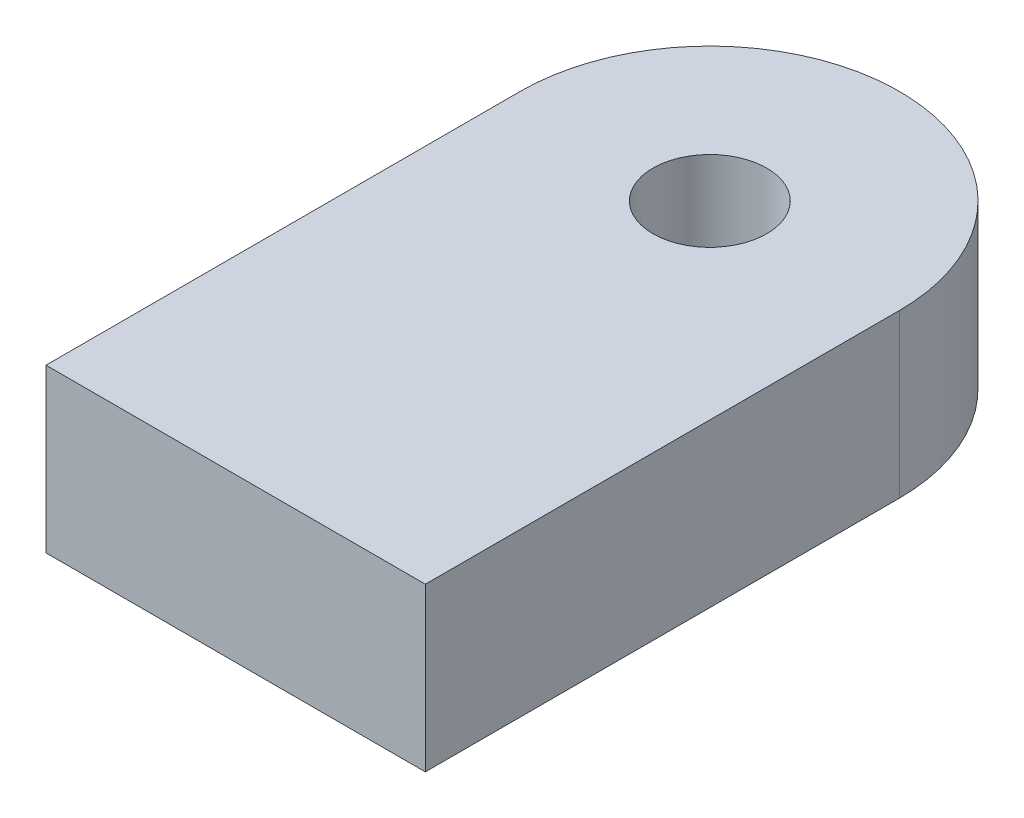
ISO-10303-21;
HEADER;
FILE_DESCRIPTION(('STEP AP214'),'2;1');
FILE_NAME('part.step','',(''),(''),'','','');
FILE_SCHEMA(('AUTOMOTIVE_DESIGN { 1 0 10303 214 1 1 1 1 }'));
ENDSEC;
DATA;
#1=APPLICATION_CONTEXT('core data for automotive mechanical design processes');
#2=APPLICATION_PROTOCOL_DEFINITION('international standard','automotive_design',2000,#1);
#3=PRODUCT_CONTEXT('',#1,'mechanical');
#4=PRODUCT('Part','Part','',(#3));
#5=PRODUCT_RELATED_PRODUCT_CATEGORY('part','',(#4));
#6=PRODUCT_DEFINITION_FORMATION('','',#4);
#7=PRODUCT_DEFINITION_CONTEXT('part definition',#1,'design');
#8=PRODUCT_DEFINITION('design','',#6,#7);
#9=PRODUCT_DEFINITION_SHAPE('','',#8);
#10=(LENGTH_UNIT() NAMED_UNIT(*) SI_UNIT(.MILLI.,.METRE.));
#11=(NAMED_UNIT(*) PLANE_ANGLE_UNIT() SI_UNIT($,.RADIAN.));
#12=(NAMED_UNIT(*) SI_UNIT($,.STERADIAN.) SOLID_ANGLE_UNIT());
#13=UNCERTAINTY_MEASURE_WITH_UNIT(LENGTH_MEASURE(1.E-05),#10,'distance_accuracy_value','');
#14=(GEOMETRIC_REPRESENTATION_CONTEXT(3) GLOBAL_UNCERTAINTY_ASSIGNED_CONTEXT((#13)) GLOBAL_UNIT_ASSIGNED_CONTEXT((#10,
#11,#12)) REPRESENTATION_CONTEXT('',''));
#15=CARTESIAN_POINT('',(0.,0.,0.));
#16=DIRECTION('',(0.,0.,1.));
#17=DIRECTION('',(1.,0.,0.));
#18=AXIS2_PLACEMENT_3D('',#15,#16,#17);
#19=CARTESIAN_POINT('',(0.,6.,-8.75));
#20=DIRECTION('',(0.,-1.,0.));
#21=DIRECTION('',(0.,0.,-1.));
#22=AXIS2_PLACEMENT_3D('',#19,#20,#21);
#23=PLANE('',#22);
#24=CARTESIAN_POINT('',(0.,6.,-8.75));
#25=DIRECTION('',(0.,1.,0.));
#26=DIRECTION('',(0.,0.,-1.));
#27=AXIS2_PLACEMENT_3D('',#24,#25,#26);
#28=CIRCLE('',#27,6.99999999999999);
#29=CARTESIAN_POINT('',(6.99999999999999,6.,-8.75));
#30=VERTEX_POINT('',#29);
#31=CARTESIAN_POINT('',(-6.99999999999999,6.,-8.75));
#32=VERTEX_POINT('',#31);
#33=EDGE_CURVE('E85',#30,#32,#28,.T.);
#34=ORIENTED_EDGE('',*,*,#33,.T.);
#35=DIRECTION('',(0.,0.,1.));
#36=VECTOR('',#35,1.);
#37=CARTESIAN_POINT('',(-7.00000000000001,6.,8.75));
#38=LINE('',#37,#36);
#39=CARTESIAN_POINT('',(-7.00000000000001,6.,8.75));
#40=VERTEX_POINT('',#39);
#41=EDGE_CURVE('E80',#32,#40,#38,.T.);
#42=ORIENTED_EDGE('',*,*,#41,.T.);
#43=DIRECTION('',(1.,0.,0.));
#44=VECTOR('',#43,1.);
#45=CARTESIAN_POINT('',(-7.00000000000001,6.,8.75));
#46=LINE('',#45,#44);
#47=CARTESIAN_POINT('',(6.99999999999999,6.,8.75000000000001));
#48=VERTEX_POINT('',#47);
#49=EDGE_CURVE('E83',#40,#48,#46,.T.);
#50=ORIENTED_EDGE('',*,*,#49,.T.);
#51=DIRECTION('',(0.,0.,-1.));
#52=VECTOR('',#51,1.);
#53=CARTESIAN_POINT('',(6.99999999999999,6.,8.75000000000001));
#54=LINE('',#53,#52);
#55=EDGE_CURVE('E50',#48,#30,#54,.T.);
#56=ORIENTED_EDGE('',*,*,#55,.T.);
#57=EDGE_LOOP('',(#34,#42,#50,#56));
#58=FACE_BOUND('',#57,.T.);
#59=CARTESIAN_POINT('',(0.,6.,-8.75));
#60=DIRECTION('',(0.,1.,0.));
#61=DIRECTION('',(0.,0.,1.));
#62=AXIS2_PLACEMENT_3D('',#59,#60,#61);
#63=CIRCLE('',#62,2.1);
#64=CARTESIAN_POINT('',(0.,6.,-6.65));
#65=VERTEX_POINT('',#64);
#66=EDGE_CURVE('E100',#65,#65,#63,.T.);
#67=ORIENTED_EDGE('',*,*,#66,.F.);
#68=EDGE_LOOP('',(#67));
#69=FACE_BOUND('',#68,.T.);
#70=ADVANCED_FACE('F33',(#58,#69),#23,.F.);
#71=CARTESIAN_POINT('',(0.,0.,-8.75));
#72=DIRECTION('',(0.,-1.,0.));
#73=DIRECTION('',(0.,0.,-1.));
#74=AXIS2_PLACEMENT_3D('',#71,#72,#73);
#75=PLANE('',#74);
#76=CARTESIAN_POINT('',(0.,0.,-8.75));
#77=DIRECTION('',(0.,1.,0.));
#78=DIRECTION('',(0.,0.,-1.));
#79=AXIS2_PLACEMENT_3D('',#76,#77,#78);
#80=CIRCLE('',#79,6.99999999999999);
#81=CARTESIAN_POINT('',(6.99999999999999,0.,-8.75));
#82=VERTEX_POINT('',#81);
#83=CARTESIAN_POINT('',(-6.99999999999999,0.,-8.75));
#84=VERTEX_POINT('',#83);
#85=EDGE_CURVE('E97',#82,#84,#80,.T.);
#86=ORIENTED_EDGE('',*,*,#85,.F.);
#87=DIRECTION('',(0.,0.,-1.));
#88=VECTOR('',#87,1.);
#89=CARTESIAN_POINT('',(6.99999999999999,0.,8.75000000000001));
#90=LINE('',#89,#88);
#91=CARTESIAN_POINT('',(6.99999999999999,0.,8.75000000000001));
#92=VERTEX_POINT('',#91);
#93=EDGE_CURVE('E73',#92,#82,#90,.T.);
#94=ORIENTED_EDGE('',*,*,#93,.F.);
#95=DIRECTION('',(1.,0.,0.));
#96=VECTOR('',#95,1.);
#97=CARTESIAN_POINT('',(-7.00000000000001,0.,8.75));
#98=LINE('',#97,#96);
#99=CARTESIAN_POINT('',(-7.00000000000001,0.,8.75));
#100=VERTEX_POINT('',#99);
#101=EDGE_CURVE('E67',#100,#92,#98,.T.);
#102=ORIENTED_EDGE('',*,*,#101,.F.);
#103=DIRECTION('',(0.,0.,1.));
#104=VECTOR('',#103,1.);
#105=CARTESIAN_POINT('',(-7.00000000000001,0.,8.75));
#106=LINE('',#105,#104);
#107=EDGE_CURVE('E89',#84,#100,#106,.T.);
#108=ORIENTED_EDGE('',*,*,#107,.F.);
#109=EDGE_LOOP('',(#86,#94,#102,#108));
#110=FACE_BOUND('',#109,.T.);
#111=CARTESIAN_POINT('',(0.,0.,-8.75));
#112=DIRECTION('',(0.,1.,0.));
#113=DIRECTION('',(0.,0.,1.));
#114=AXIS2_PLACEMENT_3D('',#111,#112,#113);
#115=CIRCLE('',#114,2.1);
#116=CARTESIAN_POINT('',(0.,0.,-6.65));
#117=VERTEX_POINT('',#116);
#118=EDGE_CURVE('E112',#117,#117,#115,.T.);
#119=ORIENTED_EDGE('',*,*,#118,.T.);
#120=EDGE_LOOP('',(#119));
#121=FACE_BOUND('',#120,.T.);
#122=ADVANCED_FACE('F108',(#110,#121),#75,.T.);
#123=CARTESIAN_POINT('',(0.,6.,-8.75));
#124=DIRECTION('',(0.,-1.,0.));
#125=DIRECTION('',(0.,0.,-1.));
#126=AXIS2_PLACEMENT_3D('',#123,#124,#125);
#127=CYLINDRICAL_SURFACE('',#126,6.99999999999999);
#128=ORIENTED_EDGE('',*,*,#85,.T.);
#129=DIRECTION('',(0.,-1.,0.));
#130=VECTOR('',#129,1.);
#131=CARTESIAN_POINT('',(-6.99999999999999,6.,-8.75));
#132=LINE('',#131,#130);
#133=EDGE_CURVE('E11',#32,#84,#132,.T.);
#134=ORIENTED_EDGE('',*,*,#133,.F.);
#135=ORIENTED_EDGE('',*,*,#33,.F.);
#136=DIRECTION('',(0.,-1.,0.));
#137=VECTOR('',#136,1.);
#138=CARTESIAN_POINT('',(6.99999999999999,6.,-8.75));
#139=LINE('',#138,#137);
#140=EDGE_CURVE('E93',#30,#82,#139,.T.);
#141=ORIENTED_EDGE('',*,*,#140,.T.);
#142=EDGE_LOOP('',(#128,#134,#135,#141));
#143=FACE_BOUND('',#142,.T.);
#144=ADVANCED_FACE('F35',(#143),#127,.T.);
#145=CARTESIAN_POINT('',(-7.00000000000001,6.,8.75));
#146=DIRECTION('',(1.,0.,0.));
#147=DIRECTION('',(0.,0.,-1.));
#148=AXIS2_PLACEMENT_3D('',#145,#146,#147);
#149=PLANE('',#148);
#150=ORIENTED_EDGE('',*,*,#107,.T.);
#151=DIRECTION('',(0.,-1.,0.));
#152=VECTOR('',#151,1.);
#153=CARTESIAN_POINT('',(-7.00000000000001,6.,8.75));
#154=LINE('',#153,#152);
#155=EDGE_CURVE('E42',#40,#100,#154,.T.);
#156=ORIENTED_EDGE('',*,*,#155,.F.);
#157=ORIENTED_EDGE('',*,*,#41,.F.);
#158=ORIENTED_EDGE('',*,*,#133,.T.);
#159=EDGE_LOOP('',(#150,#156,#157,#158));
#160=FACE_BOUND('',#159,.T.);
#161=ADVANCED_FACE('F88',(#160),#149,.F.);
#162=CARTESIAN_POINT('',(-7.00000000000001,6.,8.75));
#163=DIRECTION('',(0.,0.,-1.));
#164=DIRECTION('',(-1.,0.,0.));
#165=AXIS2_PLACEMENT_3D('',#162,#163,#164);
#166=PLANE('',#165);
#167=ORIENTED_EDGE('',*,*,#101,.T.);
#168=DIRECTION('',(0.,-1.,0.));
#169=VECTOR('',#168,1.);
#170=CARTESIAN_POINT('',(6.99999999999999,6.,8.75000000000001));
#171=LINE('',#170,#169);
#172=EDGE_CURVE('E90',#48,#92,#171,.T.);
#173=ORIENTED_EDGE('',*,*,#172,.F.);
#174=ORIENTED_EDGE('',*,*,#49,.F.);
#175=ORIENTED_EDGE('',*,*,#155,.T.);
#176=EDGE_LOOP('',(#167,#173,#174,#175));
#177=FACE_BOUND('',#176,.T.);
#178=ADVANCED_FACE('F91',(#177),#166,.F.);
#179=CARTESIAN_POINT('',(6.99999999999999,6.,8.75000000000001));
#180=DIRECTION('',(-1.,0.,0.));
#181=DIRECTION('',(0.,0.,1.));
#182=AXIS2_PLACEMENT_3D('',#179,#180,#181);
#183=PLANE('',#182);
#184=ORIENTED_EDGE('',*,*,#93,.T.);
#185=ORIENTED_EDGE('',*,*,#140,.F.);
#186=ORIENTED_EDGE('',*,*,#55,.F.);
#187=ORIENTED_EDGE('',*,*,#172,.T.);
#188=EDGE_LOOP('',(#184,#185,#186,#187));
#189=FACE_BOUND('',#188,.T.);
#190=ADVANCED_FACE('F105',(#189),#183,.F.);
#191=CARTESIAN_POINT('',(0.,6.,-8.75));
#192=DIRECTION('',(0.,-1.,0.));
#193=DIRECTION('',(0.,0.,-1.));
#194=AXIS2_PLACEMENT_3D('',#191,#192,#193);
#195=CYLINDRICAL_SURFACE('',#194,2.1);
#196=ORIENTED_EDGE('',*,*,#66,.T.);
#197=EDGE_LOOP('',(#196));
#198=FACE_BOUND('',#197,.T.);
#199=ORIENTED_EDGE('',*,*,#118,.F.);
#200=EDGE_LOOP('',(#199));
#201=FACE_BOUND('',#200,.T.);
#202=ADVANCED_FACE('F118',(#198,#201),#195,.F.);
#203=CLOSED_SHELL('',(#70,#122,#144,#161,#178,#190,#202));
#204=MANIFOLD_SOLID_BREP('B2',#203);
#205=ADVANCED_BREP_SHAPE_REPRESENTATION('',(#18,#204),#14);
#206=SHAPE_DEFINITION_REPRESENTATION(#9,#205);
ENDSEC;
END-ISO-10303-21;
